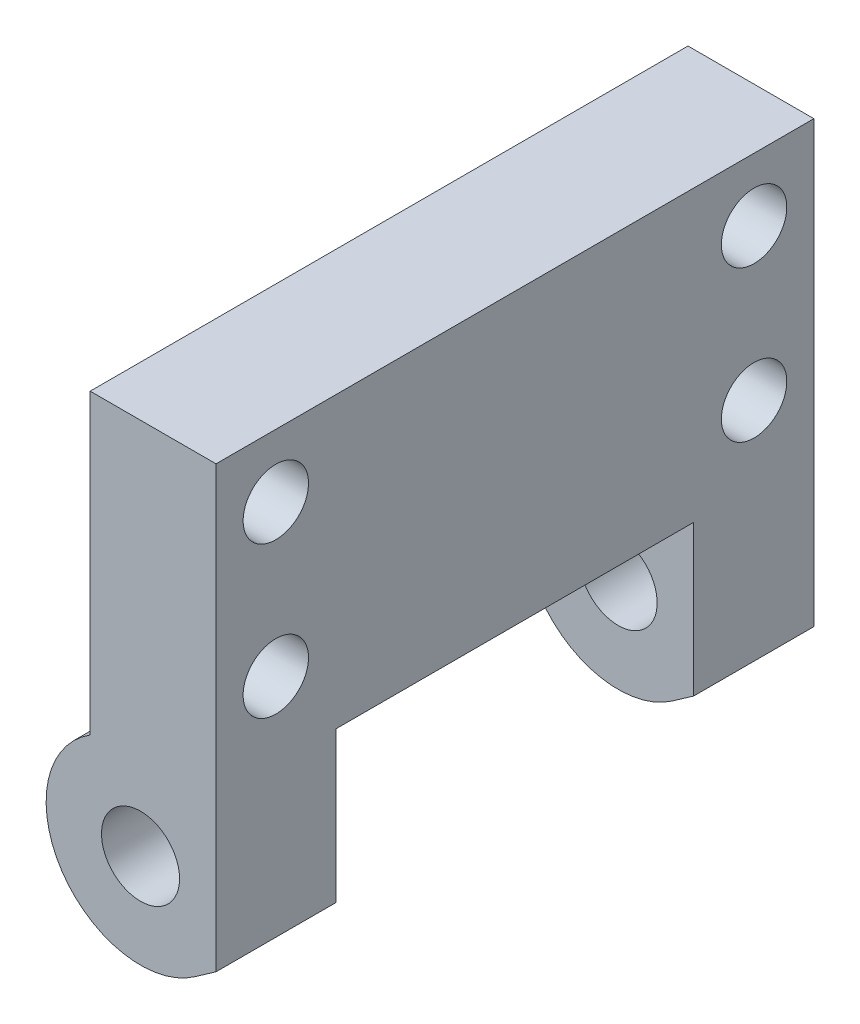
ISO-10303-21;
HEADER;
FILE_DESCRIPTION(('STEP AP214'),'2;1');
FILE_NAME('part.step','',(''),(''),'','','');
FILE_SCHEMA(('AUTOMOTIVE_DESIGN { 1 0 10303 214 1 1 1 1 }'));
ENDSEC;
DATA;
#1=APPLICATION_CONTEXT('core data for automotive mechanical design processes');
#2=APPLICATION_PROTOCOL_DEFINITION('international standard','automotive_design',2000,#1);
#3=PRODUCT_CONTEXT('',#1,'mechanical');
#4=PRODUCT('Part','Part','',(#3));
#5=PRODUCT_RELATED_PRODUCT_CATEGORY('part','',(#4));
#6=PRODUCT_DEFINITION_FORMATION('','',#4);
#7=PRODUCT_DEFINITION_CONTEXT('part definition',#1,'design');
#8=PRODUCT_DEFINITION('design','',#6,#7);
#9=PRODUCT_DEFINITION_SHAPE('','',#8);
#10=(LENGTH_UNIT() NAMED_UNIT(*) SI_UNIT(.MILLI.,.METRE.));
#11=(NAMED_UNIT(*) PLANE_ANGLE_UNIT() SI_UNIT($,.RADIAN.));
#12=(NAMED_UNIT(*) SI_UNIT($,.STERADIAN.) SOLID_ANGLE_UNIT());
#13=UNCERTAINTY_MEASURE_WITH_UNIT(LENGTH_MEASURE(1.E-05),#10,'distance_accuracy_value','');
#14=(GEOMETRIC_REPRESENTATION_CONTEXT(3) GLOBAL_UNCERTAINTY_ASSIGNED_CONTEXT((#13)) GLOBAL_UNIT_ASSIGNED_CONTEXT((#10,
#11,#12)) REPRESENTATION_CONTEXT('',''));
#15=CARTESIAN_POINT('',(0.,0.,0.));
#16=DIRECTION('',(0.,0.,1.));
#17=DIRECTION('',(1.,0.,0.));
#18=AXIS2_PLACEMENT_3D('',#15,#16,#17);
#19=CARTESIAN_POINT('',(0.,0.,47.5));
#20=DIRECTION('',(0.,0.,-1.));
#21=DIRECTION('',(-1.,0.,0.));
#22=AXIS2_PLACEMENT_3D('',#19,#20,#21);
#23=CYLINDRICAL_SURFACE('',#22,7.5);
#24=DIRECTION('',(0.,0.,-1.));
#25=VECTOR('',#24,1.);
#26=CARTESIAN_POINT('',(-4.,6.34428877022476,47.5));
#27=LINE('',#26,#25);
#28=CARTESIAN_POINT('',(-4.,6.34428877022476,47.5));
#29=VERTEX_POINT('',#28);
#30=CARTESIAN_POINT('',(-4.,6.34428877022476,37.95));
#31=VERTEX_POINT('',#30);
#32=EDGE_CURVE('E134',#29,#31,#27,.T.);
#33=ORIENTED_EDGE('',*,*,#32,.T.);
#34=CARTESIAN_POINT('',(0.,0.,37.95));
#35=DIRECTION('',(0.,0.,1.));
#36=DIRECTION('',(1.,0.,0.));
#37=AXIS2_PLACEMENT_3D('',#34,#35,#36);
#38=CIRCLE('',#37,7.5);
#39=CARTESIAN_POINT('',(4.30182327263281,-6.14364033216746,37.95));
#40=VERTEX_POINT('',#39);
#41=EDGE_CURVE('E153',#31,#40,#38,.T.);
#42=ORIENTED_EDGE('',*,*,#41,.T.);
#43=DIRECTION('',(0.,0.,-1.));
#44=VECTOR('',#43,1.);
#45=CARTESIAN_POINT('',(4.30182327263281,-6.14364033216746,47.5));
#46=LINE('',#45,#44);
#47=CARTESIAN_POINT('',(4.30182327263281,-6.14364033216746,47.5));
#48=VERTEX_POINT('',#47);
#49=EDGE_CURVE('E40',#48,#40,#46,.T.);
#50=ORIENTED_EDGE('',*,*,#49,.F.);
#51=CARTESIAN_POINT('',(0.,0.,47.5));
#52=DIRECTION('',(0.,0.,1.));
#53=DIRECTION('',(1.,0.,0.));
#54=AXIS2_PLACEMENT_3D('',#51,#52,#53);
#55=CIRCLE('',#54,7.5);
#56=EDGE_CURVE('E133',#29,#48,#55,.T.);
#57=ORIENTED_EDGE('',*,*,#56,.F.);
#58=EDGE_LOOP('',(#33,#42,#50,#57));
#59=FACE_BOUND('',#58,.T.);
#60=ADVANCED_FACE('F32',(#59),#23,.T.);
#61=CARTESIAN_POINT('',(4.30182327263281,-6.14364033216746,47.5));
#62=DIRECTION('',(-0.573576436351042,0.819152044288995,0.));
#63=DIRECTION('',(-0.819152044288995,-0.573576436351042,0.));
#64=AXIS2_PLACEMENT_3D('',#61,#62,#63);
#65=PLANE('',#64);
#66=ORIENTED_EDGE('',*,*,#49,.T.);
#67=DIRECTION('',(0.819152044288995,0.573576436351042,0.));
#68=VECTOR('',#67,1.);
#69=CARTESIAN_POINT('',(4.30182327263281,-6.14364033216746,37.95));
#70=LINE('',#69,#68);
#71=CARTESIAN_POINT('',(6.,-4.95456418645267,37.95));
#72=VERTEX_POINT('',#71);
#73=EDGE_CURVE('E168',#40,#72,#70,.T.);
#74=ORIENTED_EDGE('',*,*,#73,.T.);
#75=DIRECTION('',(0.,0.,-1.));
#76=VECTOR('',#75,1.);
#77=CARTESIAN_POINT('',(6.,-4.95456418645268,47.5));
#78=LINE('',#77,#76);
#79=CARTESIAN_POINT('',(6.,-4.95456418645268,47.5));
#80=VERTEX_POINT('',#79);
#81=EDGE_CURVE('E138',#80,#72,#78,.T.);
#82=ORIENTED_EDGE('',*,*,#81,.F.);
#83=DIRECTION('',(0.819152044288995,0.573576436351042,0.));
#84=VECTOR('',#83,1.);
#85=CARTESIAN_POINT('',(4.30182327263281,-6.14364033216746,47.5));
#86=LINE('',#85,#84);
#87=EDGE_CURVE('E90',#48,#80,#86,.T.);
#88=ORIENTED_EDGE('',*,*,#87,.F.);
#89=EDGE_LOOP('',(#66,#74,#82,#88));
#90=FACE_BOUND('',#89,.T.);
#91=ADVANCED_FACE('F180',(#90),#65,.F.);
#92=CARTESIAN_POINT('',(0.,0.,47.5));
#93=DIRECTION('',(0.,0.,-1.));
#94=DIRECTION('',(-1.,0.,0.));
#95=AXIS2_PLACEMENT_3D('',#92,#93,#94);
#96=CYLINDRICAL_SURFACE('',#95,3.1);
#97=CARTESIAN_POINT('',(0.,0.,37.95));
#98=DIRECTION('',(0.,0.,1.));
#99=DIRECTION('',(1.,0.,0.));
#100=AXIS2_PLACEMENT_3D('',#97,#98,#99);
#101=CIRCLE('',#100,3.1);
#102=CARTESIAN_POINT('',(3.1,0.,37.95));
#103=VERTEX_POINT('',#102);
#104=EDGE_CURVE('E146',#103,#103,#101,.T.);
#105=ORIENTED_EDGE('',*,*,#104,.F.);
#106=EDGE_LOOP('',(#105));
#107=FACE_BOUND('',#106,.T.);
#108=CARTESIAN_POINT('',(0.,0.,47.5));
#109=DIRECTION('',(0.,0.,1.));
#110=DIRECTION('',(1.,0.,0.));
#111=AXIS2_PLACEMENT_3D('',#108,#109,#110);
#112=CIRCLE('',#111,3.1);
#113=CARTESIAN_POINT('',(3.1,0.,47.5));
#114=VERTEX_POINT('',#113);
#115=EDGE_CURVE('E125',#114,#114,#112,.T.);
#116=ORIENTED_EDGE('',*,*,#115,.T.);
#117=EDGE_LOOP('',(#116));
#118=FACE_BOUND('',#117,.T.);
#119=ADVANCED_FACE('F292',(#107,#118),#96,.F.);
#120=CARTESIAN_POINT('',(0.,0.,47.5));
#121=DIRECTION('',(0.,0.,1.));
#122=DIRECTION('',(1.,0.,0.));
#123=AXIS2_PLACEMENT_3D('',#120,#121,#122);
#124=PLANE('',#123);
#125=ORIENTED_EDGE('',*,*,#56,.T.);
#126=ORIENTED_EDGE('',*,*,#87,.T.);
#127=DIRECTION('',(0.,1.,0.));
#128=VECTOR('',#127,1.);
#129=CARTESIAN_POINT('',(6.,30.,47.5));
#130=LINE('',#129,#128);
#131=CARTESIAN_POINT('',(6.,30.,47.5));
#132=VERTEX_POINT('',#131);
#133=EDGE_CURVE('E96',#80,#132,#130,.T.);
#134=ORIENTED_EDGE('',*,*,#133,.T.);
#135=DIRECTION('',(-1.,0.,0.));
#136=VECTOR('',#135,1.);
#137=CARTESIAN_POINT('',(-4.,30.,47.5));
#138=LINE('',#137,#136);
#139=CARTESIAN_POINT('',(-4.,30.,47.5));
#140=VERTEX_POINT('',#139);
#141=EDGE_CURVE('E101',#132,#140,#138,.T.);
#142=ORIENTED_EDGE('',*,*,#141,.T.);
#143=DIRECTION('',(0.,-1.,0.));
#144=VECTOR('',#143,1.);
#145=CARTESIAN_POINT('',(-4.,6.34428877022476,47.5));
#146=LINE('',#145,#144);
#147=EDGE_CURVE('E56',#140,#29,#146,.T.);
#148=ORIENTED_EDGE('',*,*,#147,.T.);
#149=EDGE_LOOP('',(#125,#126,#134,#142,#148));
#150=FACE_BOUND('',#149,.T.);
#151=ORIENTED_EDGE('',*,*,#115,.F.);
#152=EDGE_LOOP('',(#151));
#153=FACE_BOUND('',#152,.T.);
#154=ADVANCED_FACE('F98',(#150,#153),#124,.T.);
#155=CARTESIAN_POINT('',(0.,0.,0.));
#156=DIRECTION('',(0.,0.,1.));
#157=DIRECTION('',(1.,0.,0.));
#158=AXIS2_PLACEMENT_3D('',#155,#156,#157);
#159=PLANE('',#158);
#160=CARTESIAN_POINT('',(0.,0.,0.));
#161=DIRECTION('',(0.,0.,1.));
#162=DIRECTION('',(1.,0.,0.));
#163=AXIS2_PLACEMENT_3D('',#160,#161,#162);
#164=CIRCLE('',#163,7.5);
#165=CARTESIAN_POINT('',(-4.,6.34428877022476,0.));
#166=VERTEX_POINT('',#165);
#167=CARTESIAN_POINT('',(4.30182327263281,-6.14364033216746,0.));
#168=VERTEX_POINT('',#167);
#169=EDGE_CURVE('E122',#166,#168,#164,.T.);
#170=ORIENTED_EDGE('',*,*,#169,.F.);
#171=DIRECTION('',(0.,-1.,0.));
#172=VECTOR('',#171,1.);
#173=CARTESIAN_POINT('',(-4.,6.34428877022476,0.));
#174=LINE('',#173,#172);
#175=CARTESIAN_POINT('',(-4.,30.,0.));
#176=VERTEX_POINT('',#175);
#177=EDGE_CURVE('E131',#176,#166,#174,.T.);
#178=ORIENTED_EDGE('',*,*,#177,.F.);
#179=DIRECTION('',(-1.,0.,0.));
#180=VECTOR('',#179,1.);
#181=CARTESIAN_POINT('',(-4.,30.,0.));
#182=LINE('',#181,#180);
#183=CARTESIAN_POINT('',(6.,30.,0.));
#184=VERTEX_POINT('',#183);
#185=EDGE_CURVE('E129',#184,#176,#182,.T.);
#186=ORIENTED_EDGE('',*,*,#185,.F.);
#187=DIRECTION('',(0.,1.,0.));
#188=VECTOR('',#187,1.);
#189=CARTESIAN_POINT('',(6.,30.,0.));
#190=LINE('',#189,#188);
#191=CARTESIAN_POINT('',(6.,-4.95456418645268,0.));
#192=VERTEX_POINT('',#191);
#193=EDGE_CURVE('E110',#192,#184,#190,.T.);
#194=ORIENTED_EDGE('',*,*,#193,.F.);
#195=DIRECTION('',(0.819152044288995,0.573576436351042,0.));
#196=VECTOR('',#195,1.);
#197=CARTESIAN_POINT('',(4.30182327263281,-6.14364033216746,0.));
#198=LINE('',#197,#196);
#199=EDGE_CURVE('E124',#168,#192,#198,.T.);
#200=ORIENTED_EDGE('',*,*,#199,.F.);
#201=EDGE_LOOP('',(#170,#178,#186,#194,#200));
#202=FACE_BOUND('',#201,.T.);
#203=CARTESIAN_POINT('',(0.,0.,0.));
#204=DIRECTION('',(0.,0.,1.));
#205=DIRECTION('',(1.,0.,0.));
#206=AXIS2_PLACEMENT_3D('',#203,#204,#205);
#207=CIRCLE('',#206,3.1);
#208=CARTESIAN_POINT('',(3.1,0.,0.));
#209=VERTEX_POINT('',#208);
#210=EDGE_CURVE('E171',#209,#209,#207,.T.);
#211=ORIENTED_EDGE('',*,*,#210,.T.);
#212=EDGE_LOOP('',(#211));
#213=FACE_BOUND('',#212,.T.);
#214=ADVANCED_FACE('F224',(#202,#213),#159,.F.);
#215=CARTESIAN_POINT('',(0.,0.,9.55));
#216=DIRECTION('',(0.,0.,-1.));
#217=DIRECTION('',(-1.,0.,0.));
#218=AXIS2_PLACEMENT_3D('',#215,#216,#217);
#219=CIRCLE('',#218,7.5);
#220=CARTESIAN_POINT('',(4.30182327263281,-6.14364033216746,9.55));
#221=VERTEX_POINT('',#220);
#222=CARTESIAN_POINT('',(-4.,6.34428877022476,9.55));
#223=VERTEX_POINT('',#222);
#224=EDGE_CURVE('E156',#221,#223,#219,.T.);
#225=ORIENTED_EDGE('',*,*,#224,.T.);
#226=EDGE_CURVE('E81',#223,#166,#27,.T.);
#227=ORIENTED_EDGE('',*,*,#226,.T.);
#228=ORIENTED_EDGE('',*,*,#169,.T.);
#229=EDGE_CURVE('E140',#221,#168,#46,.T.);
#230=ORIENTED_EDGE('',*,*,#229,.F.);
#231=EDGE_LOOP('',(#225,#227,#228,#230));
#232=FACE_BOUND('',#231,.T.);
#233=ADVANCED_FACE('F34',(#232),#23,.T.);
#234=CARTESIAN_POINT('',(6.,-4.95456418645267,9.55));
#235=VERTEX_POINT('',#234);
#236=EDGE_CURVE('E113',#235,#192,#78,.T.);
#237=ORIENTED_EDGE('',*,*,#236,.F.);
#238=DIRECTION('',(-0.819152044288995,-0.573576436351042,0.));
#239=VECTOR('',#238,1.);
#240=CARTESIAN_POINT('',(4.30182327263281,-6.14364033216746,9.55));
#241=LINE('',#240,#239);
#242=EDGE_CURVE('E149',#235,#221,#241,.T.);
#243=ORIENTED_EDGE('',*,*,#242,.T.);
#244=ORIENTED_EDGE('',*,*,#229,.T.);
#245=ORIENTED_EDGE('',*,*,#199,.T.);
#246=EDGE_LOOP('',(#237,#243,#244,#245));
#247=FACE_BOUND('',#246,.T.);
#248=ADVANCED_FACE('F222',(#247),#65,.F.);
#249=CARTESIAN_POINT('',(6.,30.,47.5));
#250=DIRECTION('',(-1.,0.,0.));
#251=DIRECTION('',(0.,-1.,0.));
#252=AXIS2_PLACEMENT_3D('',#249,#250,#251);
#253=PLANE('',#252);
#254=CARTESIAN_POINT('',(6.,13.,42.75));
#255=DIRECTION('',(-1.,0.,0.));
#256=DIRECTION('',(0.,0.,1.));
#257=AXIS2_PLACEMENT_3D('',#254,#255,#256);
#258=CIRCLE('',#257,2.6);
#259=CARTESIAN_POINT('',(6.,13.,45.35));
#260=VERTEX_POINT('',#259);
#261=EDGE_CURVE('E245',#260,#260,#258,.T.);
#262=ORIENTED_EDGE('',*,*,#261,.T.);
#263=EDGE_LOOP('',(#262));
#264=FACE_BOUND('',#263,.T.);
#265=CARTESIAN_POINT('',(6.,25.,42.75));
#266=DIRECTION('',(-1.,0.,0.));
#267=DIRECTION('',(0.,0.,1.));
#268=AXIS2_PLACEMENT_3D('',#265,#266,#267);
#269=CIRCLE('',#268,2.6);
#270=CARTESIAN_POINT('',(6.,25.,45.35));
#271=VERTEX_POINT('',#270);
#272=EDGE_CURVE('E239',#271,#271,#269,.T.);
#273=ORIENTED_EDGE('',*,*,#272,.T.);
#274=EDGE_LOOP('',(#273));
#275=FACE_BOUND('',#274,.T.);
#276=CARTESIAN_POINT('',(6.,13.,4.74999999999999));
#277=DIRECTION('',(-1.,0.,0.));
#278=DIRECTION('',(0.,0.,1.));
#279=AXIS2_PLACEMENT_3D('',#276,#277,#278);
#280=CIRCLE('',#279,2.6);
#281=CARTESIAN_POINT('',(6.,13.,7.34999999999999));
#282=VERTEX_POINT('',#281);
#283=EDGE_CURVE('E234',#282,#282,#280,.T.);
#284=ORIENTED_EDGE('',*,*,#283,.T.);
#285=EDGE_LOOP('',(#284));
#286=FACE_BOUND('',#285,.T.);
#287=CARTESIAN_POINT('',(6.,25.,4.74999999999999));
#288=DIRECTION('',(-1.,0.,0.));
#289=DIRECTION('',(0.,0.,1.));
#290=AXIS2_PLACEMENT_3D('',#287,#288,#289);
#291=CIRCLE('',#290,2.6);
#292=CARTESIAN_POINT('',(6.,25.,7.35));
#293=VERTEX_POINT('',#292);
#294=EDGE_CURVE('E228',#293,#293,#291,.T.);
#295=ORIENTED_EDGE('',*,*,#294,.T.);
#296=EDGE_LOOP('',(#295));
#297=FACE_BOUND('',#296,.T.);
#298=ORIENTED_EDGE('',*,*,#81,.T.);
#299=DIRECTION('',(0.,-1.,0.));
#300=VECTOR('',#299,1.);
#301=CARTESIAN_POINT('',(6.,7.,37.95));
#302=LINE('',#301,#300);
#303=CARTESIAN_POINT('',(6.,7.,37.95));
#304=VERTEX_POINT('',#303);
#305=EDGE_CURVE('E213',#304,#72,#302,.T.);
#306=ORIENTED_EDGE('',*,*,#305,.F.);
#307=DIRECTION('',(0.,0.,1.));
#308=VECTOR('',#307,1.);
#309=CARTESIAN_POINT('',(6.,7.,37.95));
#310=LINE('',#309,#308);
#311=CARTESIAN_POINT('',(6.,7.,9.55));
#312=VERTEX_POINT('',#311);
#313=EDGE_CURVE('E206',#312,#304,#310,.T.);
#314=ORIENTED_EDGE('',*,*,#313,.F.);
#315=DIRECTION('',(0.,1.,0.));
#316=VECTOR('',#315,1.);
#317=CARTESIAN_POINT('',(6.,7.,9.55));
#318=LINE('',#317,#316);
#319=EDGE_CURVE('E211',#235,#312,#318,.T.);
#320=ORIENTED_EDGE('',*,*,#319,.F.);
#321=ORIENTED_EDGE('',*,*,#236,.T.);
#322=ORIENTED_EDGE('',*,*,#193,.T.);
#323=DIRECTION('',(0.,0.,-1.));
#324=VECTOR('',#323,1.);
#325=CARTESIAN_POINT('',(6.,30.,47.5));
#326=LINE('',#325,#324);
#327=EDGE_CURVE('E107',#132,#184,#326,.T.);
#328=ORIENTED_EDGE('',*,*,#327,.F.);
#329=ORIENTED_EDGE('',*,*,#133,.F.);
#330=EDGE_LOOP('',(#298,#306,#314,#320,#321,#322,#328,#329));
#331=FACE_BOUND('',#330,.T.);
#332=ADVANCED_FACE('F108',(#264,#275,#286,#297,#331),#253,.F.);
#333=CARTESIAN_POINT('',(-4.,30.,47.5));
#334=DIRECTION('',(0.,-1.,0.));
#335=DIRECTION('',(0.,0.,-1.));
#336=AXIS2_PLACEMENT_3D('',#333,#334,#335);
#337=PLANE('',#336);
#338=ORIENTED_EDGE('',*,*,#185,.T.);
#339=DIRECTION('',(0.,0.,-1.));
#340=VECTOR('',#339,1.);
#341=CARTESIAN_POINT('',(-4.,30.,47.5));
#342=LINE('',#341,#340);
#343=EDGE_CURVE('E114',#140,#176,#342,.T.);
#344=ORIENTED_EDGE('',*,*,#343,.F.);
#345=ORIENTED_EDGE('',*,*,#141,.F.);
#346=ORIENTED_EDGE('',*,*,#327,.T.);
#347=EDGE_LOOP('',(#338,#344,#345,#346));
#348=FACE_BOUND('',#347,.T.);
#349=ADVANCED_FACE('F116',(#348),#337,.F.);
#350=CARTESIAN_POINT('',(-4.,6.34428877022476,47.5));
#351=DIRECTION('',(1.,0.,0.));
#352=DIRECTION('',(0.,0.,-1.));
#353=AXIS2_PLACEMENT_3D('',#350,#351,#352);
#354=PLANE('',#353);
#355=CARTESIAN_POINT('',(-4.,13.,42.75));
#356=DIRECTION('',(-1.,0.,0.));
#357=DIRECTION('',(0.,0.,1.));
#358=AXIS2_PLACEMENT_3D('',#355,#356,#357);
#359=CIRCLE('',#358,2.6);
#360=CARTESIAN_POINT('',(-4.,13.,45.35));
#361=VERTEX_POINT('',#360);
#362=EDGE_CURVE('E248',#361,#361,#359,.T.);
#363=ORIENTED_EDGE('',*,*,#362,.F.);
#364=EDGE_LOOP('',(#363));
#365=FACE_BOUND('',#364,.T.);
#366=CARTESIAN_POINT('',(-4.,25.,42.75));
#367=DIRECTION('',(-1.,0.,0.));
#368=DIRECTION('',(0.,0.,1.));
#369=AXIS2_PLACEMENT_3D('',#366,#367,#368);
#370=CIRCLE('',#369,2.6);
#371=CARTESIAN_POINT('',(-4.,25.,45.35));
#372=VERTEX_POINT('',#371);
#373=EDGE_CURVE('E242',#372,#372,#370,.T.);
#374=ORIENTED_EDGE('',*,*,#373,.F.);
#375=EDGE_LOOP('',(#374));
#376=FACE_BOUND('',#375,.T.);
#377=CARTESIAN_POINT('',(-4.,13.,4.74999999999999));
#378=DIRECTION('',(-1.,0.,0.));
#379=DIRECTION('',(0.,0.,1.));
#380=AXIS2_PLACEMENT_3D('',#377,#378,#379);
#381=CIRCLE('',#380,2.6);
#382=CARTESIAN_POINT('',(-4.,13.,7.34999999999999));
#383=VERTEX_POINT('',#382);
#384=EDGE_CURVE('E236',#383,#383,#381,.T.);
#385=ORIENTED_EDGE('',*,*,#384,.F.);
#386=EDGE_LOOP('',(#385));
#387=FACE_BOUND('',#386,.T.);
#388=CARTESIAN_POINT('',(-4.,25.,4.74999999999999));
#389=DIRECTION('',(-1.,0.,0.));
#390=DIRECTION('',(0.,0.,1.));
#391=AXIS2_PLACEMENT_3D('',#388,#389,#390);
#392=CIRCLE('',#391,2.6);
#393=CARTESIAN_POINT('',(-4.,25.,7.35));
#394=VERTEX_POINT('',#393);
#395=EDGE_CURVE('E230',#394,#394,#392,.T.);
#396=ORIENTED_EDGE('',*,*,#395,.F.);
#397=EDGE_LOOP('',(#396));
#398=FACE_BOUND('',#397,.T.);
#399=DIRECTION('',(0.,0.,1.));
#400=VECTOR('',#399,1.);
#401=CARTESIAN_POINT('',(-4.,7.,47.5));
#402=LINE('',#401,#400);
#403=CARTESIAN_POINT('',(-4.,7.,9.55));
#404=VERTEX_POINT('',#403);
#405=CARTESIAN_POINT('',(-4.,7.,37.95));
#406=VERTEX_POINT('',#405);
#407=EDGE_CURVE('E11',#404,#406,#402,.T.);
#408=ORIENTED_EDGE('',*,*,#407,.T.);
#409=DIRECTION('',(0.,-1.,0.));
#410=VECTOR('',#409,1.);
#411=CARTESIAN_POINT('',(-4.,6.34428877022476,37.95));
#412=LINE('',#411,#410);
#413=EDGE_CURVE('E148',#406,#31,#412,.T.);
#414=ORIENTED_EDGE('',*,*,#413,.T.);
#415=ORIENTED_EDGE('',*,*,#32,.F.);
#416=ORIENTED_EDGE('',*,*,#147,.F.);
#417=ORIENTED_EDGE('',*,*,#343,.T.);
#418=ORIENTED_EDGE('',*,*,#177,.T.);
#419=ORIENTED_EDGE('',*,*,#226,.F.);
#420=DIRECTION('',(0.,1.,0.));
#421=VECTOR('',#420,1.);
#422=CARTESIAN_POINT('',(-4.,6.34428877022476,9.55));
#423=LINE('',#422,#421);
#424=EDGE_CURVE('E144',#223,#404,#423,.T.);
#425=ORIENTED_EDGE('',*,*,#424,.T.);
#426=EDGE_LOOP('',(#408,#414,#415,#416,#417,#418,#419,#425));
#427=FACE_BOUND('',#426,.T.);
#428=ADVANCED_FACE('F219',(#365,#376,#387,#398,#427),#354,.F.);
#429=CARTESIAN_POINT('',(0.,0.,9.55));
#430=DIRECTION('',(0.,0.,-1.));
#431=DIRECTION('',(-1.,0.,0.));
#432=AXIS2_PLACEMENT_3D('',#429,#430,#431);
#433=CIRCLE('',#432,3.1);
#434=CARTESIAN_POINT('',(-3.1,0.,9.55));
#435=VERTEX_POINT('',#434);
#436=EDGE_CURVE('E142',#435,#435,#433,.T.);
#437=ORIENTED_EDGE('',*,*,#436,.F.);
#438=EDGE_LOOP('',(#437));
#439=FACE_BOUND('',#438,.T.);
#440=ORIENTED_EDGE('',*,*,#210,.F.);
#441=EDGE_LOOP('',(#440));
#442=FACE_BOUND('',#441,.T.);
#443=ADVANCED_FACE('F265',(#439,#442),#96,.F.);
#444=CARTESIAN_POINT('',(-7.5,7.,37.95));
#445=DIRECTION('',(0.,1.,0.));
#446=DIRECTION('',(-1.,0.,0.));
#447=AXIS2_PLACEMENT_3D('',#444,#445,#446);
#448=PLANE('',#447);
#449=DIRECTION('',(1.,0.,0.));
#450=VECTOR('',#449,1.);
#451=CARTESIAN_POINT('',(-7.5,7.,9.55));
#452=LINE('',#451,#450);
#453=EDGE_CURVE('E47',#404,#312,#452,.T.);
#454=ORIENTED_EDGE('',*,*,#453,.T.);
#455=ORIENTED_EDGE('',*,*,#313,.T.);
#456=DIRECTION('',(1.,0.,0.));
#457=VECTOR('',#456,1.);
#458=CARTESIAN_POINT('',(-7.5,7.,37.95));
#459=LINE('',#458,#457);
#460=EDGE_CURVE('E145',#406,#304,#459,.T.);
#461=ORIENTED_EDGE('',*,*,#460,.F.);
#462=ORIENTED_EDGE('',*,*,#407,.F.);
#463=EDGE_LOOP('',(#454,#455,#461,#462));
#464=FACE_BOUND('',#463,.T.);
#465=ADVANCED_FACE('F203',(#464),#448,.F.);
#466=CARTESIAN_POINT('',(-7.5,7.,37.95));
#467=DIRECTION('',(0.,0.,1.));
#468=DIRECTION('',(1.,0.,0.));
#469=AXIS2_PLACEMENT_3D('',#466,#467,#468);
#470=PLANE('',#469);
#471=ORIENTED_EDGE('',*,*,#104,.T.);
#472=EDGE_LOOP('',(#471));
#473=FACE_BOUND('',#472,.T.);
#474=ORIENTED_EDGE('',*,*,#41,.F.);
#475=ORIENTED_EDGE('',*,*,#413,.F.);
#476=ORIENTED_EDGE('',*,*,#460,.T.);
#477=ORIENTED_EDGE('',*,*,#305,.T.);
#478=ORIENTED_EDGE('',*,*,#73,.F.);
#479=EDGE_LOOP('',(#474,#475,#476,#477,#478));
#480=FACE_BOUND('',#479,.T.);
#481=ADVANCED_FACE('F227',(#473,#480),#470,.F.);
#482=CARTESIAN_POINT('',(-7.5,7.,9.55));
#483=DIRECTION('',(0.,0.,-1.));
#484=DIRECTION('',(-1.,0.,0.));
#485=AXIS2_PLACEMENT_3D('',#482,#483,#484);
#486=PLANE('',#485);
#487=ORIENTED_EDGE('',*,*,#436,.T.);
#488=EDGE_LOOP('',(#487));
#489=FACE_BOUND('',#488,.T.);
#490=ORIENTED_EDGE('',*,*,#319,.T.);
#491=ORIENTED_EDGE('',*,*,#453,.F.);
#492=ORIENTED_EDGE('',*,*,#424,.F.);
#493=ORIENTED_EDGE('',*,*,#224,.F.);
#494=ORIENTED_EDGE('',*,*,#242,.F.);
#495=EDGE_LOOP('',(#490,#491,#492,#493,#494));
#496=FACE_BOUND('',#495,.T.);
#497=ADVANCED_FACE('F212',(#489,#496),#486,.F.);
#498=CARTESIAN_POINT('',(6.,25.,4.74999999999999));
#499=DIRECTION('',(-1.,0.,0.));
#500=DIRECTION('',(0.,0.,1.));
#501=AXIS2_PLACEMENT_3D('',#498,#499,#500);
#502=CYLINDRICAL_SURFACE('',#501,2.6);
#503=ORIENTED_EDGE('',*,*,#294,.F.);
#504=EDGE_LOOP('',(#503));
#505=FACE_BOUND('',#504,.T.);
#506=ORIENTED_EDGE('',*,*,#395,.T.);
#507=EDGE_LOOP('',(#506));
#508=FACE_BOUND('',#507,.T.);
#509=ADVANCED_FACE('F273',(#505,#508),#502,.F.);
#510=CARTESIAN_POINT('',(6.,13.,4.74999999999999));
#511=DIRECTION('',(-1.,0.,0.));
#512=DIRECTION('',(0.,0.,1.));
#513=AXIS2_PLACEMENT_3D('',#510,#511,#512);
#514=CYLINDRICAL_SURFACE('',#513,2.6);
#515=ORIENTED_EDGE('',*,*,#283,.F.);
#516=EDGE_LOOP('',(#515));
#517=FACE_BOUND('',#516,.T.);
#518=ORIENTED_EDGE('',*,*,#384,.T.);
#519=EDGE_LOOP('',(#518));
#520=FACE_BOUND('',#519,.T.);
#521=ADVANCED_FACE('F275',(#517,#520),#514,.F.);
#522=CARTESIAN_POINT('',(6.,25.,42.75));
#523=DIRECTION('',(-1.,0.,0.));
#524=DIRECTION('',(0.,0.,1.));
#525=AXIS2_PLACEMENT_3D('',#522,#523,#524);
#526=CYLINDRICAL_SURFACE('',#525,2.6);
#527=ORIENTED_EDGE('',*,*,#272,.F.);
#528=EDGE_LOOP('',(#527));
#529=FACE_BOUND('',#528,.T.);
#530=ORIENTED_EDGE('',*,*,#373,.T.);
#531=EDGE_LOOP('',(#530));
#532=FACE_BOUND('',#531,.T.);
#533=ADVANCED_FACE('F259',(#529,#532),#526,.F.);
#534=CARTESIAN_POINT('',(6.,13.,42.75));
#535=DIRECTION('',(-1.,0.,0.));
#536=DIRECTION('',(0.,0.,1.));
#537=AXIS2_PLACEMENT_3D('',#534,#535,#536);
#538=CYLINDRICAL_SURFACE('',#537,2.6);
#539=ORIENTED_EDGE('',*,*,#261,.F.);
#540=EDGE_LOOP('',(#539));
#541=FACE_BOUND('',#540,.T.);
#542=ORIENTED_EDGE('',*,*,#362,.T.);
#543=EDGE_LOOP('',(#542));
#544=FACE_BOUND('',#543,.T.);
#545=ADVANCED_FACE('F256',(#541,#544),#538,.F.);
#546=CLOSED_SHELL('',(#60,#91,#119,#154,#214,#233,#248,#332,#349,#428,#443,#465,#481,#497,#509,
#521,#533,#545));
#547=MANIFOLD_SOLID_BREP('B2',#546);
#548=ADVANCED_BREP_SHAPE_REPRESENTATION('',(#18,#547),#14);
#549=SHAPE_DEFINITION_REPRESENTATION(#9,#548);
ENDSEC;
END-ISO-10303-21;
